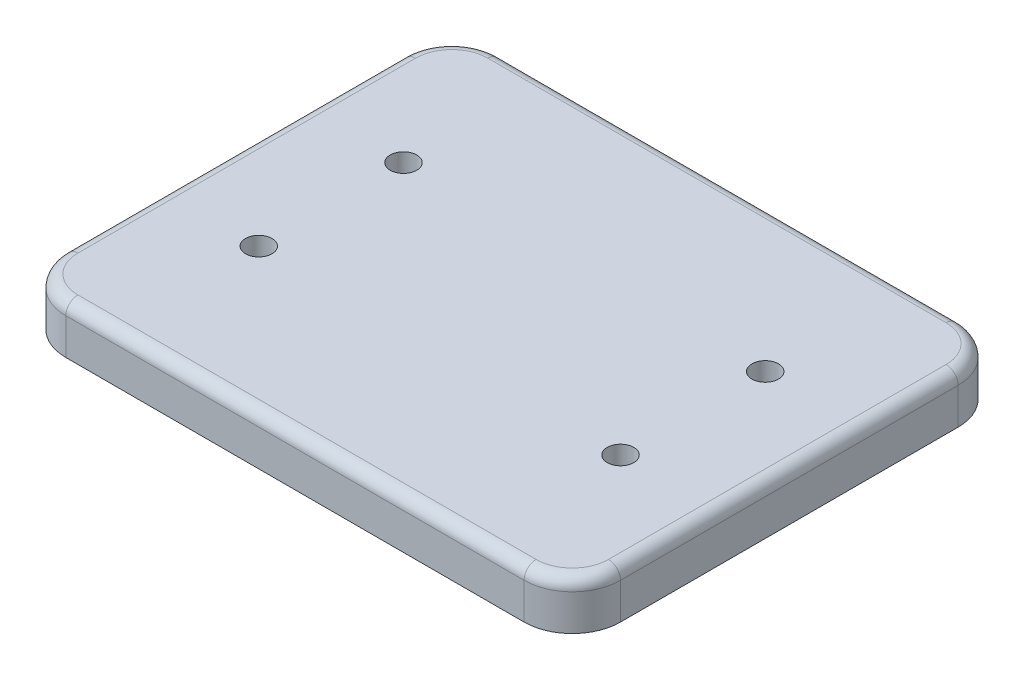
ISO-10303-21;
HEADER;
FILE_DESCRIPTION(('STEP AP214'),'2;1');
FILE_NAME('part.step','',(''),(''),'','','');
FILE_SCHEMA(('AUTOMOTIVE_DESIGN { 1 0 10303 214 1 1 1 1 }'));
ENDSEC;
DATA;
#1=APPLICATION_CONTEXT('core data for automotive mechanical design processes');
#2=APPLICATION_PROTOCOL_DEFINITION('international standard','automotive_design',2000,#1);
#3=PRODUCT_CONTEXT('',#1,'mechanical');
#4=PRODUCT('Part','Part','',(#3));
#5=PRODUCT_RELATED_PRODUCT_CATEGORY('part','',(#4));
#6=PRODUCT_DEFINITION_FORMATION('','',#4);
#7=PRODUCT_DEFINITION_CONTEXT('part definition',#1,'design');
#8=PRODUCT_DEFINITION('design','',#6,#7);
#9=PRODUCT_DEFINITION_SHAPE('','',#8);
#10=(LENGTH_UNIT() NAMED_UNIT(*) SI_UNIT(.MILLI.,.METRE.));
#11=(NAMED_UNIT(*) PLANE_ANGLE_UNIT() SI_UNIT($,.RADIAN.));
#12=(NAMED_UNIT(*) SI_UNIT($,.STERADIAN.) SOLID_ANGLE_UNIT());
#13=UNCERTAINTY_MEASURE_WITH_UNIT(LENGTH_MEASURE(1.E-05),#10,'distance_accuracy_value','');
#14=(GEOMETRIC_REPRESENTATION_CONTEXT(3) GLOBAL_UNCERTAINTY_ASSIGNED_CONTEXT((#13)) GLOBAL_UNIT_ASSIGNED_CONTEXT((#10,
#11,#12)) REPRESENTATION_CONTEXT('',''));
#15=CARTESIAN_POINT('',(0.,0.,0.));
#16=DIRECTION('',(0.,0.,1.));
#17=DIRECTION('',(1.,0.,0.));
#18=AXIS2_PLACEMENT_3D('',#15,#16,#17);
#19=CARTESIAN_POINT('',(75.,0.,30.));
#20=DIRECTION('',(0.,1.,0.));
#21=DIRECTION('',(0.,0.,1.));
#22=AXIS2_PLACEMENT_3D('',#19,#20,#21);
#23=CYLINDRICAL_SURFACE('',#22,5.5);
#24=CARTESIAN_POINT('',(75.,20.,30.));
#25=DIRECTION('',(0.,-1.,0.));
#26=DIRECTION('',(0.,0.,-1.));
#27=AXIS2_PLACEMENT_3D('',#24,#25,#26);
#28=CIRCLE('',#27,5.5);
#29=CARTESIAN_POINT('',(75.,20.,24.5));
#30=VERTEX_POINT('',#29);
#31=EDGE_CURVE('E291',#30,#30,#28,.T.);
#32=ORIENTED_EDGE('',*,*,#31,.F.);
#33=EDGE_LOOP('',(#32));
#34=FACE_BOUND('',#33,.T.);
#35=CARTESIAN_POINT('',(75.,11.,30.));
#36=DIRECTION('',(0.,-1.,0.));
#37=DIRECTION('',(0.,0.,-1.));
#38=AXIS2_PLACEMENT_3D('',#35,#36,#37);
#39=CIRCLE('',#38,5.5);
#40=CARTESIAN_POINT('',(75.,11.,24.5));
#41=VERTEX_POINT('',#40);
#42=EDGE_CURVE('E42',#41,#41,#39,.T.);
#43=ORIENTED_EDGE('',*,*,#42,.T.);
#44=EDGE_LOOP('',(#43));
#45=FACE_BOUND('',#44,.T.);
#46=ADVANCED_FACE('F38',(#34,#45),#23,.F.);
#47=CARTESIAN_POINT('',(-75.,0.,30.));
#48=DIRECTION('',(0.,1.,0.));
#49=DIRECTION('',(0.,0.,1.));
#50=AXIS2_PLACEMENT_3D('',#47,#48,#49);
#51=CYLINDRICAL_SURFACE('',#50,5.5);
#52=CARTESIAN_POINT('',(-75.,20.,30.));
#53=DIRECTION('',(0.,-1.,0.));
#54=DIRECTION('',(0.,0.,-1.));
#55=AXIS2_PLACEMENT_3D('',#52,#53,#54);
#56=CIRCLE('',#55,5.5);
#57=CARTESIAN_POINT('',(-75.,20.,24.5));
#58=VERTEX_POINT('',#57);
#59=EDGE_CURVE('E309',#58,#58,#56,.T.);
#60=ORIENTED_EDGE('',*,*,#59,.F.);
#61=EDGE_LOOP('',(#60));
#62=FACE_BOUND('',#61,.T.);
#63=CARTESIAN_POINT('',(-75.,11.,30.));
#64=DIRECTION('',(0.,-1.,0.));
#65=DIRECTION('',(0.,0.,-1.));
#66=AXIS2_PLACEMENT_3D('',#63,#64,#65);
#67=CIRCLE('',#66,5.5);
#68=CARTESIAN_POINT('',(-75.,11.,24.5));
#69=VERTEX_POINT('',#68);
#70=EDGE_CURVE('E282',#69,#69,#67,.T.);
#71=ORIENTED_EDGE('',*,*,#70,.T.);
#72=EDGE_LOOP('',(#71));
#73=FACE_BOUND('',#72,.T.);
#74=ADVANCED_FACE('F406',(#62,#73),#51,.F.);
#75=CARTESIAN_POINT('',(75.,0.,-30.));
#76=DIRECTION('',(0.,1.,0.));
#77=DIRECTION('',(0.,0.,1.));
#78=AXIS2_PLACEMENT_3D('',#75,#76,#77);
#79=CYLINDRICAL_SURFACE('',#78,5.5);
#80=CARTESIAN_POINT('',(75.,20.,-30.));
#81=DIRECTION('',(0.,1.,0.));
#82=DIRECTION('',(0.,0.,1.));
#83=AXIS2_PLACEMENT_3D('',#80,#81,#82);
#84=CIRCLE('',#83,5.5);
#85=CARTESIAN_POINT('',(75.,20.,-24.5));
#86=VERTEX_POINT('',#85);
#87=EDGE_CURVE('E161',#86,#86,#84,.T.);
#88=ORIENTED_EDGE('',*,*,#87,.T.);
#89=EDGE_LOOP('',(#88));
#90=FACE_BOUND('',#89,.T.);
#91=CARTESIAN_POINT('',(75.,11.,-30.));
#92=DIRECTION('',(0.,-1.,0.));
#93=DIRECTION('',(0.,0.,-1.));
#94=AXIS2_PLACEMENT_3D('',#91,#92,#93);
#95=CIRCLE('',#94,5.5);
#96=CARTESIAN_POINT('',(75.,11.,-35.5));
#97=VERTEX_POINT('',#96);
#98=EDGE_CURVE('E278',#97,#97,#95,.F.);
#99=ORIENTED_EDGE('',*,*,#98,.F.);
#100=EDGE_LOOP('',(#99));
#101=FACE_BOUND('',#100,.T.);
#102=ADVANCED_FACE('F338',(#90,#101),#79,.F.);
#103=CARTESIAN_POINT('',(-75.,0.,-30.));
#104=DIRECTION('',(0.,1.,0.));
#105=DIRECTION('',(0.,0.,1.));
#106=AXIS2_PLACEMENT_3D('',#103,#104,#105);
#107=CYLINDRICAL_SURFACE('',#106,5.5);
#108=CARTESIAN_POINT('',(-75.,20.,-30.));
#109=DIRECTION('',(0.,1.,0.));
#110=DIRECTION('',(0.,0.,1.));
#111=AXIS2_PLACEMENT_3D('',#108,#109,#110);
#112=CIRCLE('',#111,5.5);
#113=CARTESIAN_POINT('',(-75.,20.,-24.5));
#114=VERTEX_POINT('',#113);
#115=EDGE_CURVE('E252',#114,#114,#112,.T.);
#116=ORIENTED_EDGE('',*,*,#115,.T.);
#117=EDGE_LOOP('',(#116));
#118=FACE_BOUND('',#117,.T.);
#119=CARTESIAN_POINT('',(-75.,11.,-30.));
#120=DIRECTION('',(0.,-1.,0.));
#121=DIRECTION('',(0.,0.,-1.));
#122=AXIS2_PLACEMENT_3D('',#119,#120,#121);
#123=CIRCLE('',#122,5.5);
#124=CARTESIAN_POINT('',(-75.,11.,-35.5));
#125=VERTEX_POINT('',#124);
#126=EDGE_CURVE('E274',#125,#125,#123,.F.);
#127=ORIENTED_EDGE('',*,*,#126,.F.);
#128=EDGE_LOOP('',(#127));
#129=FACE_BOUND('',#128,.T.);
#130=ADVANCED_FACE('F435',(#118,#129),#107,.F.);
#131=CARTESIAN_POINT('',(95.,20.,70.));
#132=DIRECTION('',(0.,-1.,0.));
#133=DIRECTION('',(0.,0.,-1.));
#134=AXIS2_PLACEMENT_3D('',#131,#132,#133);
#135=CYLINDRICAL_SURFACE('',#134,20.);
#136=DIRECTION('',(0.,-1.,0.));
#137=VECTOR('',#136,1.);
#138=CARTESIAN_POINT('',(115.,20.,69.9999999999999));
#139=LINE('',#138,#137);
#140=CARTESIAN_POINT('',(115.,15.,69.9999999999999));
#141=VERTEX_POINT('',#140);
#142=CARTESIAN_POINT('',(115.,0.,69.9999999999999));
#143=VERTEX_POINT('',#142);
#144=EDGE_CURVE('E127',#141,#143,#139,.T.);
#145=ORIENTED_EDGE('',*,*,#144,.F.);
#146=CARTESIAN_POINT('',(95.,15.,70.));
#147=DIRECTION('',(0.,1.,0.));
#148=DIRECTION('',(0.,0.,1.));
#149=AXIS2_PLACEMENT_3D('',#146,#147,#148);
#150=CIRCLE('',#149,20.);
#151=CARTESIAN_POINT('',(94.9999999999998,15.,90.));
#152=VERTEX_POINT('',#151);
#153=EDGE_CURVE('E11',#141,#152,#150,.F.);
#154=ORIENTED_EDGE('',*,*,#153,.T.);
#155=DIRECTION('',(0.,-1.,0.));
#156=VECTOR('',#155,1.);
#157=CARTESIAN_POINT('',(94.9999999999998,20.,90.));
#158=LINE('',#157,#156);
#159=CARTESIAN_POINT('',(94.9999999999998,0.,90.));
#160=VERTEX_POINT('',#159);
#161=EDGE_CURVE('E151',#152,#160,#158,.T.);
#162=ORIENTED_EDGE('',*,*,#161,.T.);
#163=CARTESIAN_POINT('',(95.,0.,70.));
#164=DIRECTION('',(0.,1.,0.));
#165=DIRECTION('',(0.,0.,1.));
#166=AXIS2_PLACEMENT_3D('',#163,#164,#165);
#167=CIRCLE('',#166,20.);
#168=EDGE_CURVE('E143',#160,#143,#167,.T.);
#169=ORIENTED_EDGE('',*,*,#168,.T.);
#170=EDGE_LOOP('',(#145,#154,#162,#169));
#171=FACE_BOUND('',#170,.T.);
#172=ADVANCED_FACE('F149',(#171),#135,.T.);
#173=CARTESIAN_POINT('',(115.,20.,69.9999999999999));
#174=DIRECTION('',(-1.,0.,0.));
#175=DIRECTION('',(0.,0.,1.));
#176=AXIS2_PLACEMENT_3D('',#173,#174,#175);
#177=PLANE('',#176);
#178=DIRECTION('',(0.,-1.,0.));
#179=VECTOR('',#178,1.);
#180=CARTESIAN_POINT('',(115.,20.,-69.9999999999999));
#181=LINE('',#180,#179);
#182=CARTESIAN_POINT('',(115.,15.,-69.9999999999999));
#183=VERTEX_POINT('',#182);
#184=CARTESIAN_POINT('',(115.,0.,-69.9999999999999));
#185=VERTEX_POINT('',#184);
#186=EDGE_CURVE('E137',#183,#185,#181,.T.);
#187=ORIENTED_EDGE('',*,*,#186,.F.);
#188=DIRECTION('',(0.,0.,-1.));
#189=VECTOR('',#188,1.);
#190=CARTESIAN_POINT('',(115.,15.,69.9999999999999));
#191=LINE('',#190,#189);
#192=EDGE_CURVE('E48',#183,#141,#191,.F.);
#193=ORIENTED_EDGE('',*,*,#192,.T.);
#194=ORIENTED_EDGE('',*,*,#144,.T.);
#195=DIRECTION('',(0.,0.,-1.));
#196=VECTOR('',#195,1.);
#197=CARTESIAN_POINT('',(115.,0.,69.9999999999999));
#198=LINE('',#197,#196);
#199=EDGE_CURVE('E130',#143,#185,#198,.T.);
#200=ORIENTED_EDGE('',*,*,#199,.T.);
#201=EDGE_LOOP('',(#187,#193,#194,#200));
#202=FACE_BOUND('',#201,.T.);
#203=ADVANCED_FACE('F129',(#202),#177,.F.);
#204=CARTESIAN_POINT('',(95.,20.,-70.));
#205=DIRECTION('',(0.,-1.,0.));
#206=DIRECTION('',(0.,0.,-1.));
#207=AXIS2_PLACEMENT_3D('',#204,#205,#206);
#208=CYLINDRICAL_SURFACE('',#207,20.);
#209=DIRECTION('',(0.,-1.,0.));
#210=VECTOR('',#209,1.);
#211=CARTESIAN_POINT('',(94.9999999999998,20.,-90.));
#212=LINE('',#211,#210);
#213=CARTESIAN_POINT('',(94.9999999999998,15.,-90.));
#214=VERTEX_POINT('',#213);
#215=CARTESIAN_POINT('',(94.9999999999998,0.,-90.));
#216=VERTEX_POINT('',#215);
#217=EDGE_CURVE('E199',#214,#216,#212,.T.);
#218=ORIENTED_EDGE('',*,*,#217,.F.);
#219=CARTESIAN_POINT('',(95.,15.,-70.));
#220=DIRECTION('',(0.,1.,0.));
#221=DIRECTION('',(0.,0.,1.));
#222=AXIS2_PLACEMENT_3D('',#219,#220,#221);
#223=CIRCLE('',#222,20.);
#224=EDGE_CURVE('E63',#214,#183,#223,.F.);
#225=ORIENTED_EDGE('',*,*,#224,.T.);
#226=ORIENTED_EDGE('',*,*,#186,.T.);
#227=CARTESIAN_POINT('',(95.,0.,-70.));
#228=DIRECTION('',(0.,1.,0.));
#229=DIRECTION('',(0.,0.,-1.));
#230=AXIS2_PLACEMENT_3D('',#227,#228,#229);
#231=CIRCLE('',#230,20.);
#232=EDGE_CURVE('E146',#185,#216,#231,.T.);
#233=ORIENTED_EDGE('',*,*,#232,.T.);
#234=EDGE_LOOP('',(#218,#225,#226,#233));
#235=FACE_BOUND('',#234,.T.);
#236=ADVANCED_FACE('F623',(#235),#208,.T.);
#237=CARTESIAN_POINT('',(-94.9999999999999,20.,-90.));
#238=DIRECTION('',(0.,0.,1.));
#239=DIRECTION('',(1.,0.,0.));
#240=AXIS2_PLACEMENT_3D('',#237,#238,#239);
#241=PLANE('',#240);
#242=DIRECTION('',(0.,-1.,0.));
#243=VECTOR('',#242,1.);
#244=CARTESIAN_POINT('',(-95.,20.,-90.));
#245=LINE('',#244,#243);
#246=CARTESIAN_POINT('',(-95.,15.,-90.));
#247=VERTEX_POINT('',#246);
#248=CARTESIAN_POINT('',(-95.,0.,-90.));
#249=VERTEX_POINT('',#248);
#250=EDGE_CURVE('E196',#247,#249,#245,.T.);
#251=ORIENTED_EDGE('',*,*,#250,.F.);
#252=DIRECTION('',(-1.,0.,0.));
#253=VECTOR('',#252,1.);
#254=CARTESIAN_POINT('',(94.9999999999998,15.,-90.));
#255=LINE('',#254,#253);
#256=EDGE_CURVE('E241',#247,#214,#255,.F.);
#257=ORIENTED_EDGE('',*,*,#256,.T.);
#258=ORIENTED_EDGE('',*,*,#217,.T.);
#259=DIRECTION('',(-1.,0.,0.));
#260=VECTOR('',#259,1.);
#261=CARTESIAN_POINT('',(-94.9999999999999,0.,-90.));
#262=LINE('',#261,#260);
#263=EDGE_CURVE('E166',#216,#249,#262,.T.);
#264=ORIENTED_EDGE('',*,*,#263,.T.);
#265=EDGE_LOOP('',(#251,#257,#258,#264));
#266=FACE_BOUND('',#265,.T.);
#267=ADVANCED_FACE('F615',(#266),#241,.F.);
#268=CARTESIAN_POINT('',(-95.,20.,-70.));
#269=DIRECTION('',(0.,-1.,0.));
#270=DIRECTION('',(0.,0.,-1.));
#271=AXIS2_PLACEMENT_3D('',#268,#269,#270);
#272=CYLINDRICAL_SURFACE('',#271,20.);
#273=DIRECTION('',(0.,-1.,0.));
#274=VECTOR('',#273,1.);
#275=CARTESIAN_POINT('',(-115.,20.,-69.9999999999999));
#276=LINE('',#275,#274);
#277=CARTESIAN_POINT('',(-115.,15.,-69.9999999999999));
#278=VERTEX_POINT('',#277);
#279=CARTESIAN_POINT('',(-115.,0.,-69.9999999999999));
#280=VERTEX_POINT('',#279);
#281=EDGE_CURVE('E193',#278,#280,#276,.T.);
#282=ORIENTED_EDGE('',*,*,#281,.F.);
#283=CARTESIAN_POINT('',(-95.,15.,-70.));
#284=DIRECTION('',(0.,1.,0.));
#285=DIRECTION('',(0.,0.,1.));
#286=AXIS2_PLACEMENT_3D('',#283,#284,#285);
#287=CIRCLE('',#286,20.);
#288=EDGE_CURVE('E238',#278,#247,#287,.F.);
#289=ORIENTED_EDGE('',*,*,#288,.T.);
#290=ORIENTED_EDGE('',*,*,#250,.T.);
#291=CARTESIAN_POINT('',(-95.,0.,-70.));
#292=DIRECTION('',(0.,1.,0.));
#293=DIRECTION('',(0.,0.,-1.));
#294=AXIS2_PLACEMENT_3D('',#291,#292,#293);
#295=CIRCLE('',#294,20.);
#296=EDGE_CURVE('E170',#249,#280,#295,.T.);
#297=ORIENTED_EDGE('',*,*,#296,.T.);
#298=EDGE_LOOP('',(#282,#289,#290,#297));
#299=FACE_BOUND('',#298,.T.);
#300=ADVANCED_FACE('F388',(#299),#272,.T.);
#301=CARTESIAN_POINT('',(-115.,20.,69.9999999999999));
#302=DIRECTION('',(1.,0.,0.));
#303=DIRECTION('',(0.,0.,-1.));
#304=AXIS2_PLACEMENT_3D('',#301,#302,#303);
#305=PLANE('',#304);
#306=DIRECTION('',(0.,-1.,0.));
#307=VECTOR('',#306,1.);
#308=CARTESIAN_POINT('',(-115.,20.,69.9999999999999));
#309=LINE('',#308,#307);
#310=CARTESIAN_POINT('',(-115.,15.,69.9999999999999));
#311=VERTEX_POINT('',#310);
#312=CARTESIAN_POINT('',(-115.,0.,69.9999999999999));
#313=VERTEX_POINT('',#312);
#314=EDGE_CURVE('E190',#311,#313,#309,.T.);
#315=ORIENTED_EDGE('',*,*,#314,.F.);
#316=DIRECTION('',(0.,0.,1.));
#317=VECTOR('',#316,1.);
#318=CARTESIAN_POINT('',(-115.,15.,-69.9999999999998));
#319=LINE('',#318,#317);
#320=EDGE_CURVE('E235',#311,#278,#319,.F.);
#321=ORIENTED_EDGE('',*,*,#320,.T.);
#322=ORIENTED_EDGE('',*,*,#281,.T.);
#323=DIRECTION('',(0.,0.,1.));
#324=VECTOR('',#323,1.);
#325=CARTESIAN_POINT('',(-115.,0.,69.9999999999999));
#326=LINE('',#325,#324);
#327=EDGE_CURVE('E174',#280,#313,#326,.T.);
#328=ORIENTED_EDGE('',*,*,#327,.T.);
#329=EDGE_LOOP('',(#315,#321,#322,#328));
#330=FACE_BOUND('',#329,.T.);
#331=ADVANCED_FACE('F386',(#330),#305,.F.);
#332=CARTESIAN_POINT('',(-95.,20.,70.));
#333=DIRECTION('',(0.,-1.,0.));
#334=DIRECTION('',(0.,0.,-1.));
#335=AXIS2_PLACEMENT_3D('',#332,#333,#334);
#336=CYLINDRICAL_SURFACE('',#335,20.);
#337=DIRECTION('',(0.,-1.,0.));
#338=VECTOR('',#337,1.);
#339=CARTESIAN_POINT('',(-94.9999999999999,20.,90.));
#340=LINE('',#339,#338);
#341=CARTESIAN_POINT('',(-94.9999999999999,15.,90.));
#342=VERTEX_POINT('',#341);
#343=CARTESIAN_POINT('',(-94.9999999999999,0.,90.));
#344=VERTEX_POINT('',#343);
#345=EDGE_CURVE('E187',#342,#344,#340,.T.);
#346=ORIENTED_EDGE('',*,*,#345,.F.);
#347=CARTESIAN_POINT('',(-95.,15.,70.));
#348=DIRECTION('',(0.,1.,0.));
#349=DIRECTION('',(0.,0.,1.));
#350=AXIS2_PLACEMENT_3D('',#347,#348,#349);
#351=CIRCLE('',#350,20.);
#352=EDGE_CURVE('E232',#342,#311,#351,.F.);
#353=ORIENTED_EDGE('',*,*,#352,.T.);
#354=ORIENTED_EDGE('',*,*,#314,.T.);
#355=CARTESIAN_POINT('',(-95.,0.,70.));
#356=DIRECTION('',(0.,1.,0.));
#357=DIRECTION('',(0.,0.,-1.));
#358=AXIS2_PLACEMENT_3D('',#355,#356,#357);
#359=CIRCLE('',#358,20.);
#360=EDGE_CURVE('E178',#313,#344,#359,.T.);
#361=ORIENTED_EDGE('',*,*,#360,.T.);
#362=EDGE_LOOP('',(#346,#353,#354,#361));
#363=FACE_BOUND('',#362,.T.);
#364=ADVANCED_FACE('F395',(#363),#336,.T.);
#365=CARTESIAN_POINT('',(-94.9999999999999,20.,90.));
#366=DIRECTION('',(0.,0.,-1.));
#367=DIRECTION('',(-1.,0.,0.));
#368=AXIS2_PLACEMENT_3D('',#365,#366,#367);
#369=PLANE('',#368);
#370=ORIENTED_EDGE('',*,*,#161,.F.);
#371=DIRECTION('',(1.,0.,0.));
#372=VECTOR('',#371,1.);
#373=CARTESIAN_POINT('',(-94.9999999999999,15.,90.));
#374=LINE('',#373,#372);
#375=EDGE_CURVE('E228',#152,#342,#374,.F.);
#376=ORIENTED_EDGE('',*,*,#375,.T.);
#377=ORIENTED_EDGE('',*,*,#345,.T.);
#378=DIRECTION('',(1.,0.,0.));
#379=VECTOR('',#378,1.);
#380=CARTESIAN_POINT('',(-94.9999999999999,0.,90.));
#381=LINE('',#380,#379);
#382=EDGE_CURVE('E182',#344,#160,#381,.T.);
#383=ORIENTED_EDGE('',*,*,#382,.T.);
#384=EDGE_LOOP('',(#370,#376,#377,#383));
#385=FACE_BOUND('',#384,.T.);
#386=ADVANCED_FACE('F344',(#385),#369,.F.);
#387=CARTESIAN_POINT('',(95.,20.,70.));
#388=DIRECTION('',(0.,1.,0.));
#389=DIRECTION('',(0.,0.,1.));
#390=AXIS2_PLACEMENT_3D('',#387,#388,#389);
#391=PLANE('',#390);
#392=ORIENTED_EDGE('',*,*,#59,.T.);
#393=EDGE_LOOP('',(#392));
#394=FACE_BOUND('',#393,.T.);
#395=ORIENTED_EDGE('',*,*,#31,.T.);
#396=EDGE_LOOP('',(#395));
#397=FACE_BOUND('',#396,.T.);
#398=ORIENTED_EDGE('',*,*,#115,.F.);
#399=EDGE_LOOP('',(#398));
#400=FACE_BOUND('',#399,.T.);
#401=ORIENTED_EDGE('',*,*,#87,.F.);
#402=EDGE_LOOP('',(#401));
#403=FACE_BOUND('',#402,.T.);
#404=CARTESIAN_POINT('',(-95.,20.,70.));
#405=DIRECTION('',(0.,1.,0.));
#406=DIRECTION('',(0.,0.,1.));
#407=AXIS2_PLACEMENT_3D('',#404,#405,#406);
#408=CIRCLE('',#407,15.);
#409=CARTESIAN_POINT('',(-110.,20.,69.9999999999999));
#410=VERTEX_POINT('',#409);
#411=CARTESIAN_POINT('',(-94.9999999999999,20.,85.));
#412=VERTEX_POINT('',#411);
#413=EDGE_CURVE('E221',#410,#412,#408,.T.);
#414=ORIENTED_EDGE('',*,*,#413,.T.);
#415=DIRECTION('',(1.,0.,0.));
#416=VECTOR('',#415,1.);
#417=CARTESIAN_POINT('',(94.9999999999998,20.,85.));
#418=LINE('',#417,#416);
#419=CARTESIAN_POINT('',(94.9999999999998,20.,85.));
#420=VERTEX_POINT('',#419);
#421=EDGE_CURVE('E224',#412,#420,#418,.T.);
#422=ORIENTED_EDGE('',*,*,#421,.T.);
#423=CARTESIAN_POINT('',(95.,20.,70.));
#424=DIRECTION('',(0.,1.,0.));
#425=DIRECTION('',(0.,0.,1.));
#426=AXIS2_PLACEMENT_3D('',#423,#424,#425);
#427=CIRCLE('',#426,15.);
#428=CARTESIAN_POINT('',(110.,20.,69.9999999999999));
#429=VERTEX_POINT('',#428);
#430=EDGE_CURVE('E136',#420,#429,#427,.T.);
#431=ORIENTED_EDGE('',*,*,#430,.T.);
#432=DIRECTION('',(0.,0.,-1.));
#433=VECTOR('',#432,1.);
#434=CARTESIAN_POINT('',(110.,20.,-69.9999999999998));
#435=LINE('',#434,#433);
#436=CARTESIAN_POINT('',(110.,20.,-69.9999999999999));
#437=VERTEX_POINT('',#436);
#438=EDGE_CURVE('E206',#429,#437,#435,.T.);
#439=ORIENTED_EDGE('',*,*,#438,.T.);
#440=CARTESIAN_POINT('',(95.,20.,-70.));
#441=DIRECTION('',(0.,1.,0.));
#442=DIRECTION('',(0.,0.,1.));
#443=AXIS2_PLACEMENT_3D('',#440,#441,#442);
#444=CIRCLE('',#443,15.);
#445=CARTESIAN_POINT('',(94.9999999999998,20.,-85.));
#446=VERTEX_POINT('',#445);
#447=EDGE_CURVE('E209',#437,#446,#444,.T.);
#448=ORIENTED_EDGE('',*,*,#447,.T.);
#449=DIRECTION('',(-1.,0.,0.));
#450=VECTOR('',#449,1.);
#451=CARTESIAN_POINT('',(-95.,20.,-85.));
#452=LINE('',#451,#450);
#453=CARTESIAN_POINT('',(-95.,20.,-85.));
#454=VERTEX_POINT('',#453);
#455=EDGE_CURVE('E212',#446,#454,#452,.T.);
#456=ORIENTED_EDGE('',*,*,#455,.T.);
#457=CARTESIAN_POINT('',(-95.,20.,-70.));
#458=DIRECTION('',(0.,1.,0.));
#459=DIRECTION('',(0.,0.,1.));
#460=AXIS2_PLACEMENT_3D('',#457,#458,#459);
#461=CIRCLE('',#460,15.);
#462=CARTESIAN_POINT('',(-110.,20.,-69.9999999999999));
#463=VERTEX_POINT('',#462);
#464=EDGE_CURVE('E215',#454,#463,#461,.T.);
#465=ORIENTED_EDGE('',*,*,#464,.T.);
#466=DIRECTION('',(0.,0.,1.));
#467=VECTOR('',#466,1.);
#468=CARTESIAN_POINT('',(-110.,20.,69.9999999999999));
#469=LINE('',#468,#467);
#470=EDGE_CURVE('E218',#463,#410,#469,.T.);
#471=ORIENTED_EDGE('',*,*,#470,.T.);
#472=EDGE_LOOP('',(#414,#422,#431,#439,#448,#456,#465,#471));
#473=FACE_BOUND('',#472,.T.);
#474=ADVANCED_FACE('F341',(#394,#397,#400,#403,#473),#391,.T.);
#475=CARTESIAN_POINT('',(95.,0.,70.));
#476=DIRECTION('',(0.,1.,0.));
#477=DIRECTION('',(0.,0.,1.));
#478=AXIS2_PLACEMENT_3D('',#475,#476,#477);
#479=PLANE('',#478);
#480=CARTESIAN_POINT('',(-75.,0.,30.));
#481=DIRECTION('',(0.,1.,0.));
#482=DIRECTION('',(0.,0.,1.));
#483=AXIS2_PLACEMENT_3D('',#480,#481,#482);
#484=CIRCLE('',#483,9.);
#485=CARTESIAN_POINT('',(-75.,0.,39.));
#486=VERTEX_POINT('',#485);
#487=EDGE_CURVE('E293',#486,#486,#484,.T.);
#488=ORIENTED_EDGE('',*,*,#487,.T.);
#489=EDGE_LOOP('',(#488));
#490=FACE_BOUND('',#489,.T.);
#491=CARTESIAN_POINT('',(75.,0.,30.));
#492=DIRECTION('',(0.,1.,0.));
#493=DIRECTION('',(0.,0.,1.));
#494=AXIS2_PLACEMENT_3D('',#491,#492,#493);
#495=CIRCLE('',#494,9.);
#496=CARTESIAN_POINT('',(75.,0.,39.));
#497=VERTEX_POINT('',#496);
#498=EDGE_CURVE('E305',#497,#497,#495,.T.);
#499=ORIENTED_EDGE('',*,*,#498,.T.);
#500=EDGE_LOOP('',(#499));
#501=FACE_BOUND('',#500,.T.);
#502=CARTESIAN_POINT('',(-75.,0.,-30.));
#503=DIRECTION('',(0.,-1.,0.));
#504=DIRECTION('',(0.,0.,-1.));
#505=AXIS2_PLACEMENT_3D('',#502,#503,#504);
#506=CIRCLE('',#505,9.);
#507=CARTESIAN_POINT('',(-75.,0.,-39.));
#508=VERTEX_POINT('',#507);
#509=EDGE_CURVE('E320',#508,#508,#506,.T.);
#510=ORIENTED_EDGE('',*,*,#509,.F.);
#511=EDGE_LOOP('',(#510));
#512=FACE_BOUND('',#511,.T.);
#513=CARTESIAN_POINT('',(75.,0.,-30.));
#514=DIRECTION('',(0.,-1.,0.));
#515=DIRECTION('',(0.,0.,-1.));
#516=AXIS2_PLACEMENT_3D('',#513,#514,#515);
#517=CIRCLE('',#516,9.);
#518=CARTESIAN_POINT('',(75.,0.,-39.));
#519=VERTEX_POINT('',#518);
#520=EDGE_CURVE('E313',#519,#519,#517,.T.);
#521=ORIENTED_EDGE('',*,*,#520,.F.);
#522=EDGE_LOOP('',(#521));
#523=FACE_BOUND('',#522,.T.);
#524=ORIENTED_EDGE('',*,*,#168,.F.);
#525=ORIENTED_EDGE('',*,*,#382,.F.);
#526=ORIENTED_EDGE('',*,*,#360,.F.);
#527=ORIENTED_EDGE('',*,*,#327,.F.);
#528=ORIENTED_EDGE('',*,*,#296,.F.);
#529=ORIENTED_EDGE('',*,*,#263,.F.);
#530=ORIENTED_EDGE('',*,*,#232,.F.);
#531=ORIENTED_EDGE('',*,*,#199,.F.);
#532=EDGE_LOOP('',(#524,#525,#526,#527,#528,#529,#530,#531));
#533=FACE_BOUND('',#532,.T.);
#534=ADVANCED_FACE('F141',(#490,#501,#512,#523,#533),#479,.F.);
#535=CARTESIAN_POINT('',(95.,15.,-85.));
#536=DIRECTION('',(1.,0.,0.));
#537=DIRECTION('',(0.,0.,-1.));
#538=AXIS2_PLACEMENT_3D('',#535,#536,#537);
#539=CYLINDRICAL_SURFACE('',#538,5.);
#540=CARTESIAN_POINT('',(94.9999999999998,15.,-85.));
#541=DIRECTION('',(1.,0.,0.));
#542=DIRECTION('',(0.,0.,-1.));
#543=AXIS2_PLACEMENT_3D('',#540,#541,#542);
#544=CIRCLE('',#543,5.);
#545=EDGE_CURVE('E158',#214,#446,#544,.T.);
#546=ORIENTED_EDGE('',*,*,#545,.F.);
#547=ORIENTED_EDGE('',*,*,#256,.F.);
#548=CARTESIAN_POINT('',(-95.,15.,-85.));
#549=DIRECTION('',(-1.,0.,0.));
#550=DIRECTION('',(0.,0.,1.));
#551=AXIS2_PLACEMENT_3D('',#548,#549,#550);
#552=CIRCLE('',#551,5.);
#553=EDGE_CURVE('E154',#454,#247,#552,.T.);
#554=ORIENTED_EDGE('',*,*,#553,.F.);
#555=ORIENTED_EDGE('',*,*,#455,.F.);
#556=EDGE_LOOP('',(#546,#547,#554,#555));
#557=FACE_BOUND('',#556,.T.);
#558=ADVANCED_FACE('F40',(#557),#539,.T.);
#559=CARTESIAN_POINT('',(-95.,15.,-70.));
#560=DIRECTION('',(0.,1.,0.));
#561=DIRECTION('',(0.,0.,1.));
#562=AXIS2_PLACEMENT_3D('',#559,#560,#561);
#563=TOROIDAL_SURFACE('',#562,15.,5.);
#564=ORIENTED_EDGE('',*,*,#553,.T.);
#565=ORIENTED_EDGE('',*,*,#288,.F.);
#566=CARTESIAN_POINT('',(-110.,15.,-69.9999999999999));
#567=DIRECTION('',(0.,0.,1.));
#568=DIRECTION('',(1.,0.,0.));
#569=AXIS2_PLACEMENT_3D('',#566,#567,#568);
#570=CIRCLE('',#569,5.);
#571=EDGE_CURVE('E267',#463,#278,#570,.T.);
#572=ORIENTED_EDGE('',*,*,#571,.F.);
#573=ORIENTED_EDGE('',*,*,#464,.F.);
#574=EDGE_LOOP('',(#564,#565,#572,#573));
#575=FACE_BOUND('',#574,.T.);
#576=ADVANCED_FACE('F379',(#575),#563,.T.);
#577=CARTESIAN_POINT('',(95.,15.,-70.));
#578=DIRECTION('',(0.,1.,0.));
#579=DIRECTION('',(0.,0.,1.));
#580=AXIS2_PLACEMENT_3D('',#577,#578,#579);
#581=TOROIDAL_SURFACE('',#580,15.,5.);
#582=ORIENTED_EDGE('',*,*,#545,.T.);
#583=ORIENTED_EDGE('',*,*,#447,.F.);
#584=CARTESIAN_POINT('',(110.,15.,-69.9999999999999));
#585=DIRECTION('',(0.,0.,1.));
#586=DIRECTION('',(1.,0.,0.));
#587=AXIS2_PLACEMENT_3D('',#584,#585,#586);
#588=CIRCLE('',#587,5.);
#589=EDGE_CURVE('E263',#183,#437,#588,.T.);
#590=ORIENTED_EDGE('',*,*,#589,.F.);
#591=ORIENTED_EDGE('',*,*,#224,.F.);
#592=EDGE_LOOP('',(#582,#583,#590,#591));
#593=FACE_BOUND('',#592,.T.);
#594=ADVANCED_FACE('F369',(#593),#581,.T.);
#595=CARTESIAN_POINT('',(-110.,15.,70.));
#596=DIRECTION('',(0.,0.,-1.));
#597=DIRECTION('',(-1.,0.,0.));
#598=AXIS2_PLACEMENT_3D('',#595,#596,#597);
#599=CYLINDRICAL_SURFACE('',#598,5.);
#600=ORIENTED_EDGE('',*,*,#571,.T.);
#601=ORIENTED_EDGE('',*,*,#320,.F.);
#602=CARTESIAN_POINT('',(-110.,15.,69.9999999999999));
#603=DIRECTION('',(0.,0.,1.));
#604=DIRECTION('',(1.,0.,0.));
#605=AXIS2_PLACEMENT_3D('',#602,#603,#604);
#606=CIRCLE('',#605,5.);
#607=EDGE_CURVE('E259',#410,#311,#606,.T.);
#608=ORIENTED_EDGE('',*,*,#607,.F.);
#609=ORIENTED_EDGE('',*,*,#470,.F.);
#610=EDGE_LOOP('',(#600,#601,#608,#609));
#611=FACE_BOUND('',#610,.T.);
#612=ADVANCED_FACE('F382',(#611),#599,.T.);
#613=CARTESIAN_POINT('',(110.,15.,70.));
#614=DIRECTION('',(0.,0.,1.));
#615=DIRECTION('',(1.,0.,0.));
#616=AXIS2_PLACEMENT_3D('',#613,#614,#615);
#617=CYLINDRICAL_SURFACE('',#616,5.);
#618=ORIENTED_EDGE('',*,*,#589,.T.);
#619=ORIENTED_EDGE('',*,*,#438,.F.);
#620=CARTESIAN_POINT('',(110.,15.,69.9999999999999));
#621=DIRECTION('',(0.,0.,1.));
#622=DIRECTION('',(1.,0.,0.));
#623=AXIS2_PLACEMENT_3D('',#620,#621,#622);
#624=CIRCLE('',#623,5.);
#625=EDGE_CURVE('E255',#141,#429,#624,.T.);
#626=ORIENTED_EDGE('',*,*,#625,.F.);
#627=ORIENTED_EDGE('',*,*,#192,.F.);
#628=EDGE_LOOP('',(#618,#619,#626,#627));
#629=FACE_BOUND('',#628,.T.);
#630=ADVANCED_FACE('F366',(#629),#617,.T.);
#631=CARTESIAN_POINT('',(-95.,15.,70.));
#632=DIRECTION('',(0.,1.,0.));
#633=DIRECTION('',(0.,0.,1.));
#634=AXIS2_PLACEMENT_3D('',#631,#632,#633);
#635=TOROIDAL_SURFACE('',#634,15.,5.);
#636=ORIENTED_EDGE('',*,*,#607,.T.);
#637=ORIENTED_EDGE('',*,*,#352,.F.);
#638=CARTESIAN_POINT('',(-94.9999999999999,15.,85.));
#639=DIRECTION('',(1.,0.,0.));
#640=DIRECTION('',(0.,0.,-1.));
#641=AXIS2_PLACEMENT_3D('',#638,#639,#640);
#642=CIRCLE('',#641,5.);
#643=EDGE_CURVE('E251',#412,#342,#642,.T.);
#644=ORIENTED_EDGE('',*,*,#643,.F.);
#645=ORIENTED_EDGE('',*,*,#413,.F.);
#646=EDGE_LOOP('',(#636,#637,#644,#645));
#647=FACE_BOUND('',#646,.T.);
#648=ADVANCED_FACE('F354',(#647),#635,.T.);
#649=CARTESIAN_POINT('',(95.,15.,70.));
#650=DIRECTION('',(0.,1.,0.));
#651=DIRECTION('',(0.,0.,1.));
#652=AXIS2_PLACEMENT_3D('',#649,#650,#651);
#653=TOROIDAL_SURFACE('',#652,15.,5.);
#654=ORIENTED_EDGE('',*,*,#625,.T.);
#655=ORIENTED_EDGE('',*,*,#430,.F.);
#656=CARTESIAN_POINT('',(94.9999999999999,15.,85.));
#657=DIRECTION('',(-1.,0.,0.));
#658=DIRECTION('',(0.,0.,1.));
#659=AXIS2_PLACEMENT_3D('',#656,#657,#658);
#660=CIRCLE('',#659,5.);
#661=EDGE_CURVE('E248',#152,#420,#660,.T.);
#662=ORIENTED_EDGE('',*,*,#661,.F.);
#663=ORIENTED_EDGE('',*,*,#153,.F.);
#664=EDGE_LOOP('',(#654,#655,#662,#663));
#665=FACE_BOUND('',#664,.T.);
#666=ADVANCED_FACE('F362',(#665),#653,.T.);
#667=CARTESIAN_POINT('',(95.,15.,85.));
#668=DIRECTION('',(-1.,0.,0.));
#669=DIRECTION('',(0.,0.,1.));
#670=AXIS2_PLACEMENT_3D('',#667,#668,#669);
#671=CYLINDRICAL_SURFACE('',#670,5.);
#672=ORIENTED_EDGE('',*,*,#643,.T.);
#673=ORIENTED_EDGE('',*,*,#375,.F.);
#674=ORIENTED_EDGE('',*,*,#661,.T.);
#675=ORIENTED_EDGE('',*,*,#421,.F.);
#676=EDGE_LOOP('',(#672,#673,#674,#675));
#677=FACE_BOUND('',#676,.T.);
#678=ADVANCED_FACE('F357',(#677),#671,.T.);
#679=CARTESIAN_POINT('',(-75.,11.,-30.));
#680=DIRECTION('',(0.,-1.,0.));
#681=DIRECTION('',(0.,0.,-1.));
#682=AXIS2_PLACEMENT_3D('',#679,#680,#681);
#683=PLANE('',#682);
#684=CARTESIAN_POINT('',(-75.,11.,-30.));
#685=DIRECTION('',(0.,-1.,0.));
#686=DIRECTION('',(0.,0.,-1.));
#687=AXIS2_PLACEMENT_3D('',#684,#685,#686);
#688=CIRCLE('',#687,9.);
#689=CARTESIAN_POINT('',(-75.,11.,-39.));
#690=VERTEX_POINT('',#689);
#691=EDGE_CURVE('E279',#690,#690,#688,.T.);
#692=ORIENTED_EDGE('',*,*,#691,.T.);
#693=EDGE_LOOP('',(#692));
#694=FACE_BOUND('',#693,.T.);
#695=ORIENTED_EDGE('',*,*,#126,.T.);
#696=EDGE_LOOP('',(#695));
#697=FACE_BOUND('',#696,.T.);
#698=ADVANCED_FACE('F419',(#694,#697),#683,.T.);
#699=CARTESIAN_POINT('',(-75.,11.,-30.));
#700=DIRECTION('',(0.,-1.,0.));
#701=DIRECTION('',(0.,0.,-1.));
#702=AXIS2_PLACEMENT_3D('',#699,#700,#701);
#703=CYLINDRICAL_SURFACE('',#702,9.);
#704=ORIENTED_EDGE('',*,*,#691,.F.);
#705=EDGE_LOOP('',(#704));
#706=FACE_BOUND('',#705,.T.);
#707=ORIENTED_EDGE('',*,*,#509,.T.);
#708=EDGE_LOOP('',(#707));
#709=FACE_BOUND('',#708,.T.);
#710=ADVANCED_FACE('F422',(#706,#709),#703,.F.);
#711=CARTESIAN_POINT('',(75.,11.,-30.));
#712=DIRECTION('',(0.,-1.,0.));
#713=DIRECTION('',(0.,0.,-1.));
#714=AXIS2_PLACEMENT_3D('',#711,#712,#713);
#715=PLANE('',#714);
#716=CARTESIAN_POINT('',(75.,11.,-30.));
#717=DIRECTION('',(0.,-1.,0.));
#718=DIRECTION('',(0.,0.,-1.));
#719=AXIS2_PLACEMENT_3D('',#716,#717,#718);
#720=CIRCLE('',#719,9.);
#721=CARTESIAN_POINT('',(75.,11.,-39.));
#722=VERTEX_POINT('',#721);
#723=EDGE_CURVE('E324',#722,#722,#720,.T.);
#724=ORIENTED_EDGE('',*,*,#723,.T.);
#725=EDGE_LOOP('',(#724));
#726=FACE_BOUND('',#725,.T.);
#727=ORIENTED_EDGE('',*,*,#98,.T.);
#728=EDGE_LOOP('',(#727));
#729=FACE_BOUND('',#728,.T.);
#730=ADVANCED_FACE('F426',(#726,#729),#715,.T.);
#731=CARTESIAN_POINT('',(75.,11.,-30.));
#732=DIRECTION('',(0.,-1.,0.));
#733=DIRECTION('',(0.,0.,-1.));
#734=AXIS2_PLACEMENT_3D('',#731,#732,#733);
#735=CYLINDRICAL_SURFACE('',#734,9.);
#736=ORIENTED_EDGE('',*,*,#723,.F.);
#737=EDGE_LOOP('',(#736));
#738=FACE_BOUND('',#737,.T.);
#739=ORIENTED_EDGE('',*,*,#520,.T.);
#740=EDGE_LOOP('',(#739));
#741=FACE_BOUND('',#740,.T.);
#742=ADVANCED_FACE('F430',(#738,#741),#735,.F.);
#743=CARTESIAN_POINT('',(-75.,11.,30.));
#744=DIRECTION('',(0.,-1.,0.));
#745=DIRECTION('',(0.,0.,-1.));
#746=AXIS2_PLACEMENT_3D('',#743,#744,#745);
#747=CYLINDRICAL_SURFACE('',#746,9.);
#748=CARTESIAN_POINT('',(-75.,11.,30.));
#749=DIRECTION('',(0.,1.,0.));
#750=DIRECTION('',(0.,0.,1.));
#751=AXIS2_PLACEMENT_3D('',#748,#749,#750);
#752=CIRCLE('',#751,9.);
#753=CARTESIAN_POINT('',(-75.,11.,39.));
#754=VERTEX_POINT('',#753);
#755=EDGE_CURVE('E285',#754,#754,#752,.T.);
#756=ORIENTED_EDGE('',*,*,#755,.T.);
#757=EDGE_LOOP('',(#756));
#758=FACE_BOUND('',#757,.T.);
#759=ORIENTED_EDGE('',*,*,#487,.F.);
#760=EDGE_LOOP('',(#759));
#761=FACE_BOUND('',#760,.T.);
#762=ADVANCED_FACE('F433',(#758,#761),#747,.F.);
#763=CARTESIAN_POINT('',(-75.,11.,30.));
#764=DIRECTION('',(0.,-1.,0.));
#765=DIRECTION('',(0.,0.,1.));
#766=AXIS2_PLACEMENT_3D('',#763,#764,#765);
#767=PLANE('',#766);
#768=ORIENTED_EDGE('',*,*,#70,.F.);
#769=EDGE_LOOP('',(#768));
#770=FACE_BOUND('',#769,.T.);
#771=ORIENTED_EDGE('',*,*,#755,.F.);
#772=EDGE_LOOP('',(#771));
#773=FACE_BOUND('',#772,.T.);
#774=ADVANCED_FACE('F458',(#770,#773),#767,.T.);
#775=CARTESIAN_POINT('',(75.,11.,30.));
#776=DIRECTION('',(0.,-1.,0.));
#777=DIRECTION('',(0.,0.,-1.));
#778=AXIS2_PLACEMENT_3D('',#775,#776,#777);
#779=CYLINDRICAL_SURFACE('',#778,9.);
#780=CARTESIAN_POINT('',(75.,11.,30.));
#781=DIRECTION('',(0.,1.,0.));
#782=DIRECTION('',(0.,0.,1.));
#783=AXIS2_PLACEMENT_3D('',#780,#781,#782);
#784=CIRCLE('',#783,9.);
#785=CARTESIAN_POINT('',(75.,11.,39.));
#786=VERTEX_POINT('',#785);
#787=EDGE_CURVE('E299',#786,#786,#784,.T.);
#788=ORIENTED_EDGE('',*,*,#787,.T.);
#789=EDGE_LOOP('',(#788));
#790=FACE_BOUND('',#789,.T.);
#791=ORIENTED_EDGE('',*,*,#498,.F.);
#792=EDGE_LOOP('',(#791));
#793=FACE_BOUND('',#792,.T.);
#794=ADVANCED_FACE('F455',(#790,#793),#779,.F.);
#795=CARTESIAN_POINT('',(75.,11.,30.));
#796=DIRECTION('',(0.,-1.,0.));
#797=DIRECTION('',(0.,0.,1.));
#798=AXIS2_PLACEMENT_3D('',#795,#796,#797);
#799=PLANE('',#798);
#800=ORIENTED_EDGE('',*,*,#42,.F.);
#801=EDGE_LOOP('',(#800));
#802=FACE_BOUND('',#801,.T.);
#803=ORIENTED_EDGE('',*,*,#787,.F.);
#804=EDGE_LOOP('',(#803));
#805=FACE_BOUND('',#804,.T.);
#806=ADVANCED_FACE('F457',(#802,#805),#799,.T.);
#807=CLOSED_SHELL('',(#46,#74,#102,#130,#172,#203,#236,#267,#300,#331,#364,#386,#474,#534,#558,
#576,#594,#612,#630,#648,#666,#678,#698,#710,#730,#742,#762,#774,#794,#806));
#808=MANIFOLD_SOLID_BREP('B2',#807);
#809=ADVANCED_BREP_SHAPE_REPRESENTATION('',(#18,#808),#14);
#810=SHAPE_DEFINITION_REPRESENTATION(#9,#809);
ENDSEC;
END-ISO-10303-21;
